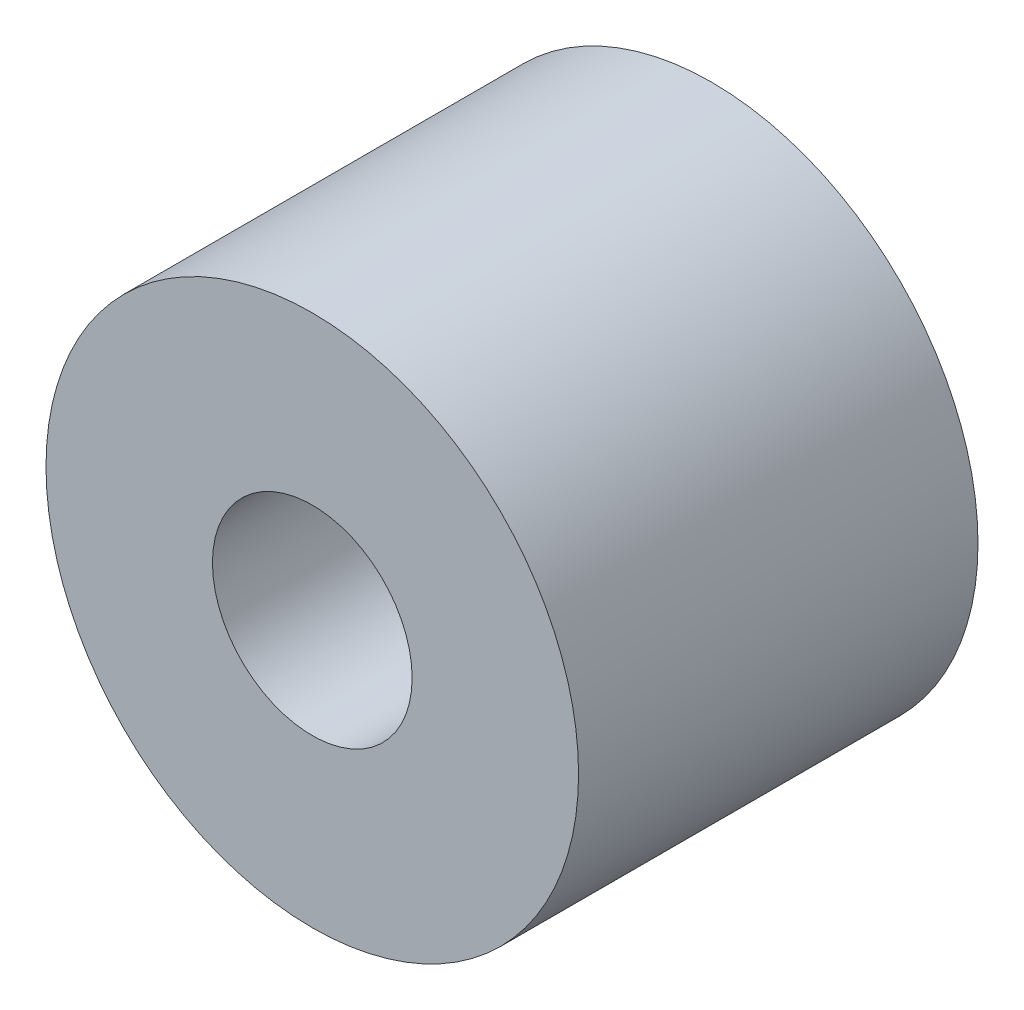
ISO-10303-21;
HEADER;
FILE_DESCRIPTION(('STEP AP214'),'2;1');
FILE_NAME('part.step','',(''),(''),'','','');
FILE_SCHEMA(('AUTOMOTIVE_DESIGN { 1 0 10303 214 1 1 1 1 }'));
ENDSEC;
DATA;
#1=APPLICATION_CONTEXT('core data for automotive mechanical design processes');
#2=APPLICATION_PROTOCOL_DEFINITION('international standard','automotive_design',2000,#1);
#3=PRODUCT_CONTEXT('',#1,'mechanical');
#4=PRODUCT('Part','Part','',(#3));
#5=PRODUCT_RELATED_PRODUCT_CATEGORY('part','',(#4));
#6=PRODUCT_DEFINITION_FORMATION('','',#4);
#7=PRODUCT_DEFINITION_CONTEXT('part definition',#1,'design');
#8=PRODUCT_DEFINITION('design','',#6,#7);
#9=PRODUCT_DEFINITION_SHAPE('','',#8);
#10=(LENGTH_UNIT() NAMED_UNIT(*) SI_UNIT(.MILLI.,.METRE.));
#11=(NAMED_UNIT(*) PLANE_ANGLE_UNIT() SI_UNIT($,.RADIAN.));
#12=(NAMED_UNIT(*) SI_UNIT($,.STERADIAN.) SOLID_ANGLE_UNIT());
#13=UNCERTAINTY_MEASURE_WITH_UNIT(LENGTH_MEASURE(1.E-05),#10,'distance_accuracy_value','');
#14=(GEOMETRIC_REPRESENTATION_CONTEXT(3) GLOBAL_UNCERTAINTY_ASSIGNED_CONTEXT((#13)) GLOBAL_UNIT_ASSIGNED_CONTEXT((#10,
#11,#12)) REPRESENTATION_CONTEXT('',''));
#15=CARTESIAN_POINT('',(0.,0.,0.));
#16=DIRECTION('',(0.,0.,1.));
#17=DIRECTION('',(1.,0.,0.));
#18=AXIS2_PLACEMENT_3D('',#15,#16,#17);
#19=CARTESIAN_POINT('',(0.,0.,90.));
#20=DIRECTION('',(0.,0.,1.));
#21=DIRECTION('',(1.,0.,0.));
#22=AXIS2_PLACEMENT_3D('',#19,#20,#21);
#23=PLANE('',#22);
#24=CARTESIAN_POINT('',(0.,0.,90.));
#25=DIRECTION('',(0.,0.,1.));
#26=DIRECTION('',(1.,0.,0.));
#27=AXIS2_PLACEMENT_3D('',#24,#25,#26);
#28=CIRCLE('',#27,60.);
#29=CARTESIAN_POINT('',(60.,0.,90.));
#30=VERTEX_POINT('',#29);
#31=EDGE_CURVE('E10',#30,#30,#28,.T.);
#32=ORIENTED_EDGE('',*,*,#31,.T.);
#33=EDGE_LOOP('',(#32));
#34=FACE_BOUND('',#33,.T.);
#35=CARTESIAN_POINT('',(0.,0.,90.));
#36=DIRECTION('',(0.,0.,1.));
#37=DIRECTION('',(1.,0.,0.));
#38=AXIS2_PLACEMENT_3D('',#35,#36,#37);
#39=CIRCLE('',#38,22.5);
#40=CARTESIAN_POINT('',(22.5,0.,90.));
#41=VERTEX_POINT('',#40);
#42=EDGE_CURVE('E46',#41,#41,#39,.T.);
#43=ORIENTED_EDGE('',*,*,#42,.F.);
#44=EDGE_LOOP('',(#43));
#45=FACE_BOUND('',#44,.T.);
#46=ADVANCED_FACE('F35',(#34,#45),#23,.T.);
#47=CARTESIAN_POINT('',(0.,0.,0.));
#48=DIRECTION('',(0.,0.,1.));
#49=DIRECTION('',(1.,0.,0.));
#50=AXIS2_PLACEMENT_3D('',#47,#48,#49);
#51=PLANE('',#50);
#52=CARTESIAN_POINT('',(0.,0.,0.));
#53=DIRECTION('',(0.,0.,1.));
#54=DIRECTION('',(1.,0.,0.));
#55=AXIS2_PLACEMENT_3D('',#52,#53,#54);
#56=CIRCLE('',#55,60.);
#57=CARTESIAN_POINT('',(60.,0.,0.));
#58=VERTEX_POINT('',#57);
#59=EDGE_CURVE('E39',#58,#58,#56,.T.);
#60=ORIENTED_EDGE('',*,*,#59,.F.);
#61=EDGE_LOOP('',(#60));
#62=FACE_BOUND('',#61,.T.);
#63=CARTESIAN_POINT('',(0.,0.,0.));
#64=DIRECTION('',(0.,0.,1.));
#65=DIRECTION('',(1.,0.,0.));
#66=AXIS2_PLACEMENT_3D('',#63,#64,#65);
#67=CIRCLE('',#66,22.5);
#68=CARTESIAN_POINT('',(22.5,0.,0.));
#69=VERTEX_POINT('',#68);
#70=EDGE_CURVE('E48',#69,#69,#67,.T.);
#71=ORIENTED_EDGE('',*,*,#70,.T.);
#72=EDGE_LOOP('',(#71));
#73=FACE_BOUND('',#72,.T.);
#74=ADVANCED_FACE('F58',(#62,#73),#51,.F.);
#75=CARTESIAN_POINT('',(0.,0.,90.));
#76=DIRECTION('',(0.,0.,-1.));
#77=DIRECTION('',(-1.,0.,0.));
#78=AXIS2_PLACEMENT_3D('',#75,#76,#77);
#79=CYLINDRICAL_SURFACE('',#78,60.);
#80=ORIENTED_EDGE('',*,*,#31,.F.);
#81=EDGE_LOOP('',(#80));
#82=FACE_BOUND('',#81,.T.);
#83=ORIENTED_EDGE('',*,*,#59,.T.);
#84=EDGE_LOOP('',(#83));
#85=FACE_BOUND('',#84,.T.);
#86=ADVANCED_FACE('F37',(#82,#85),#79,.T.);
#87=CARTESIAN_POINT('',(0.,0.,90.));
#88=DIRECTION('',(0.,0.,-1.));
#89=DIRECTION('',(-1.,0.,0.));
#90=AXIS2_PLACEMENT_3D('',#87,#88,#89);
#91=CYLINDRICAL_SURFACE('',#90,22.5);
#92=ORIENTED_EDGE('',*,*,#42,.T.);
#93=EDGE_LOOP('',(#92));
#94=FACE_BOUND('',#93,.T.);
#95=ORIENTED_EDGE('',*,*,#70,.F.);
#96=EDGE_LOOP('',(#95));
#97=FACE_BOUND('',#96,.T.);
#98=ADVANCED_FACE('F54',(#94,#97),#91,.F.);
#99=CLOSED_SHELL('',(#46,#74,#86,#98));
#100=MANIFOLD_SOLID_BREP('B2',#99);
#101=ADVANCED_BREP_SHAPE_REPRESENTATION('',(#18,#100),#14);
#102=SHAPE_DEFINITION_REPRESENTATION(#9,#101);
ENDSEC;
END-ISO-10303-21;
